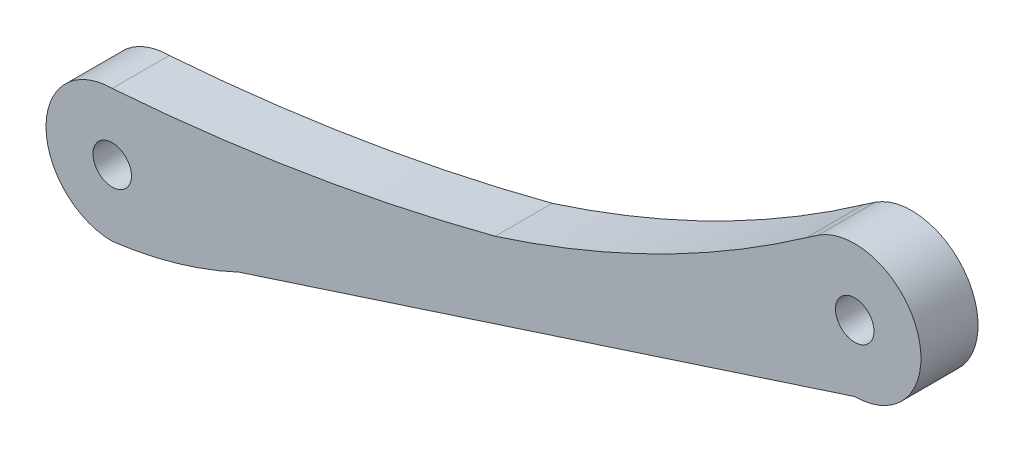
ISO-10303-21;
HEADER;
FILE_DESCRIPTION(('STEP AP214'),'2;1');
FILE_NAME('part.step','',(''),(''),'','','');
FILE_SCHEMA(('AUTOMOTIVE_DESIGN { 1 0 10303 214 1 1 1 1 }'));
ENDSEC;
DATA;
#1=APPLICATION_CONTEXT('core data for automotive mechanical design processes');
#2=APPLICATION_PROTOCOL_DEFINITION('international standard','automotive_design',2000,#1);
#3=PRODUCT_CONTEXT('',#1,'mechanical');
#4=PRODUCT('Part','Part','',(#3));
#5=PRODUCT_RELATED_PRODUCT_CATEGORY('part','',(#4));
#6=PRODUCT_DEFINITION_FORMATION('','',#4);
#7=PRODUCT_DEFINITION_CONTEXT('part definition',#1,'design');
#8=PRODUCT_DEFINITION('design','',#6,#7);
#9=PRODUCT_DEFINITION_SHAPE('','',#8);
#10=(LENGTH_UNIT() NAMED_UNIT(*) SI_UNIT(.MILLI.,.METRE.));
#11=(NAMED_UNIT(*) PLANE_ANGLE_UNIT() SI_UNIT($,.RADIAN.));
#12=(NAMED_UNIT(*) SI_UNIT($,.STERADIAN.) SOLID_ANGLE_UNIT());
#13=UNCERTAINTY_MEASURE_WITH_UNIT(LENGTH_MEASURE(1.E-05),#10,'distance_accuracy_value','');
#14=(GEOMETRIC_REPRESENTATION_CONTEXT(3) GLOBAL_UNCERTAINTY_ASSIGNED_CONTEXT((#13)) GLOBAL_UNIT_ASSIGNED_CONTEXT((#10,
#11,#12)) REPRESENTATION_CONTEXT('',''));
#15=CARTESIAN_POINT('',(0.,0.,0.));
#16=DIRECTION('',(0.,0.,1.));
#17=DIRECTION('',(1.,0.,0.));
#18=AXIS2_PLACEMENT_3D('',#15,#16,#17);
#19=CARTESIAN_POINT('',(3.52092702977232,128.68718187856,-6.));
#20=DIRECTION('',(0.,0.,1.));
#21=DIRECTION('',(-1.,0.,0.));
#22=AXIS2_PLACEMENT_3D('',#19,#20,#21);
#23=CYLINDRICAL_SURFACE('',#22,120.781117317153);
#24=CARTESIAN_POINT('',(3.52092702977232,128.68718187856,0.));
#25=DIRECTION('',(0.,0.,1.));
#26=DIRECTION('',(1.,0.,0.));
#27=AXIS2_PLACEMENT_3D('',#24,#25,#26);
#28=CIRCLE('',#27,120.781117317153);
#29=CARTESIAN_POINT('',(40.235925581119,13.6216041337166,0.));
#30=VERTEX_POINT('',#29);
#31=CARTESIAN_POINT('',(72.9383830734779,29.8474373584522,0.));
#32=VERTEX_POINT('',#31);
#33=EDGE_CURVE('E134',#30,#32,#28,.T.);
#34=ORIENTED_EDGE('',*,*,#33,.T.);
#35=DIRECTION('',(0.,0.,1.));
#36=VECTOR('',#35,1.);
#37=CARTESIAN_POINT('',(72.9383830734779,29.8474373584522,-6.));
#38=LINE('',#37,#36);
#39=CARTESIAN_POINT('',(72.9383830734779,29.8474373584522,-6.));
#40=VERTEX_POINT('',#39);
#41=EDGE_CURVE('E133',#40,#32,#38,.T.);
#42=ORIENTED_EDGE('',*,*,#41,.F.);
#43=CARTESIAN_POINT('',(3.52092702977232,128.68718187856,-6.));
#44=DIRECTION('',(0.,0.,1.));
#45=DIRECTION('',(1.,0.,0.));
#46=AXIS2_PLACEMENT_3D('',#43,#44,#45);
#47=CIRCLE('',#46,120.781117317153);
#48=CARTESIAN_POINT('',(40.235925581119,13.6216041337166,-6.));
#49=VERTEX_POINT('',#48);
#50=EDGE_CURVE('E155',#49,#40,#47,.T.);
#51=ORIENTED_EDGE('',*,*,#50,.F.);
#52=DIRECTION('',(0.,0.,1.));
#53=VECTOR('',#52,1.);
#54=CARTESIAN_POINT('',(40.235925581119,13.6216041337166,-6.));
#55=LINE('',#54,#53);
#56=EDGE_CURVE('E11',#49,#30,#55,.T.);
#57=ORIENTED_EDGE('',*,*,#56,.T.);
#58=EDGE_LOOP('',(#34,#42,#51,#57));
#59=FACE_BOUND('',#58,.T.);
#60=ADVANCED_FACE('F37',(#59),#23,.F.);
#61=CARTESIAN_POINT('',(-16.5000266118403,231.345266574188,-6.));
#62=DIRECTION('',(0.,0.,1.));
#63=DIRECTION('',(-1.,0.,0.));
#64=AXIS2_PLACEMENT_3D('',#61,#62,#63);
#65=CYLINDRICAL_SURFACE('',#64,224.994580951929);
#66=CARTESIAN_POINT('',(-16.5000266118403,231.345266574188,0.));
#67=DIRECTION('',(0.,0.,1.));
#68=DIRECTION('',(1.,0.,0.));
#69=AXIS2_PLACEMENT_3D('',#66,#67,#68);
#70=CIRCLE('',#69,224.994580951929);
#71=CARTESIAN_POINT('',(0.,6.95651779309902,0.));
#72=VERTEX_POINT('',#71);
#73=EDGE_CURVE('E137',#72,#30,#70,.T.);
#74=ORIENTED_EDGE('',*,*,#73,.T.);
#75=ORIENTED_EDGE('',*,*,#56,.F.);
#76=CARTESIAN_POINT('',(-16.5000266118403,231.345266574188,-6.));
#77=DIRECTION('',(0.,0.,1.));
#78=DIRECTION('',(1.,0.,0.));
#79=AXIS2_PLACEMENT_3D('',#76,#77,#78);
#80=CIRCLE('',#79,224.994580951929);
#81=CARTESIAN_POINT('',(0.,6.95651779309902,-6.));
#82=VERTEX_POINT('',#81);
#83=EDGE_CURVE('E88',#82,#49,#80,.T.);
#84=ORIENTED_EDGE('',*,*,#83,.F.);
#85=DIRECTION('',(0.,0.,1.));
#86=VECTOR('',#85,1.);
#87=CARTESIAN_POINT('',(0.,6.95651779309902,-6.));
#88=LINE('',#87,#86);
#89=EDGE_CURVE('E45',#82,#72,#88,.T.);
#90=ORIENTED_EDGE('',*,*,#89,.T.);
#91=EDGE_LOOP('',(#74,#75,#84,#90));
#92=FACE_BOUND('',#91,.T.);
#93=ADVANCED_FACE('F165',(#92),#65,.F.);
#94=CARTESIAN_POINT('',(0.,0.,-6.));
#95=DIRECTION('',(0.,0.,1.));
#96=DIRECTION('',(-1.,0.,0.));
#97=AXIS2_PLACEMENT_3D('',#94,#95,#96);
#98=CYLINDRICAL_SURFACE('',#97,6.95651779309902);
#99=CARTESIAN_POINT('',(0.,0.,0.));
#100=DIRECTION('',(0.,0.,1.));
#101=DIRECTION('',(1.,0.,0.));
#102=AXIS2_PLACEMENT_3D('',#99,#100,#101);
#103=CIRCLE('',#102,6.95651779309902);
#104=CARTESIAN_POINT('',(0.,-6.95651779309902,0.));
#105=VERTEX_POINT('',#104);
#106=EDGE_CURVE('E139',#72,#105,#103,.T.);
#107=ORIENTED_EDGE('',*,*,#106,.F.);
#108=ORIENTED_EDGE('',*,*,#89,.F.);
#109=CARTESIAN_POINT('',(0.,0.,-6.));
#110=DIRECTION('',(0.,0.,1.));
#111=DIRECTION('',(1.,0.,0.));
#112=AXIS2_PLACEMENT_3D('',#109,#110,#111);
#113=CIRCLE('',#112,6.95651779309902);
#114=CARTESIAN_POINT('',(0.,-6.95651779309902,-6.));
#115=VERTEX_POINT('',#114);
#116=EDGE_CURVE('E122',#82,#115,#113,.T.);
#117=ORIENTED_EDGE('',*,*,#116,.T.);
#118=DIRECTION('',(0.,0.,1.));
#119=VECTOR('',#118,1.);
#120=CARTESIAN_POINT('',(0.,-6.95651779309902,-6.));
#121=LINE('',#120,#119);
#122=EDGE_CURVE('E159',#115,#105,#121,.T.);
#123=ORIENTED_EDGE('',*,*,#122,.T.);
#124=EDGE_LOOP('',(#107,#108,#117,#123));
#125=FACE_BOUND('',#124,.T.);
#126=ADVANCED_FACE('F175',(#125),#98,.T.);
#127=CARTESIAN_POINT('',(-5.43504198912419,36.7736432938048,-6.));
#128=DIRECTION('',(0.,0.,1.));
#129=DIRECTION('',(-1.,0.,0.));
#130=AXIS2_PLACEMENT_3D('',#127,#128,#129);
#131=CYLINDRICAL_SURFACE('',#130,44.0666162770651);
#132=CARTESIAN_POINT('',(-5.43504198912419,36.7736432938048,0.));
#133=DIRECTION('',(0.,0.,1.));
#134=DIRECTION('',(1.,0.,0.));
#135=AXIS2_PLACEMENT_3D('',#132,#133,#134);
#136=CIRCLE('',#135,44.0666162770651);
#137=CARTESIAN_POINT('',(13.3235006682701,-3.10095698608287,0.));
#138=VERTEX_POINT('',#137);
#139=EDGE_CURVE('E142',#105,#138,#136,.T.);
#140=ORIENTED_EDGE('',*,*,#139,.F.);
#141=ORIENTED_EDGE('',*,*,#122,.F.);
#142=CARTESIAN_POINT('',(-5.43504198912419,36.7736432938048,-6.));
#143=DIRECTION('',(0.,0.,1.));
#144=DIRECTION('',(1.,0.,0.));
#145=AXIS2_PLACEMENT_3D('',#142,#143,#144);
#146=CIRCLE('',#145,44.0666162770651);
#147=CARTESIAN_POINT('',(13.3235006682701,-3.10095698608287,-6.));
#148=VERTEX_POINT('',#147);
#149=EDGE_CURVE('E120',#115,#148,#146,.T.);
#150=ORIENTED_EDGE('',*,*,#149,.T.);
#151=DIRECTION('',(0.,0.,1.));
#152=VECTOR('',#151,1.);
#153=CARTESIAN_POINT('',(13.3235006682701,-3.10095698608287,-6.));
#154=LINE('',#153,#152);
#155=EDGE_CURVE('E114',#148,#138,#154,.T.);
#156=ORIENTED_EDGE('',*,*,#155,.T.);
#157=EDGE_LOOP('',(#140,#141,#150,#156));
#158=FACE_BOUND('',#157,.T.);
#159=ADVANCED_FACE('F178',(#158),#131,.T.);
#160=CARTESIAN_POINT('',(2.18464276354417,-6.72139803148819,-6.));
#161=DIRECTION('',(-0.309110183145973,0.951026232380297,0.));
#162=DIRECTION('',(-0.951026232380297,-0.309110183145973,0.));
#163=AXIS2_PLACEMENT_3D('',#160,#161,#162);
#164=PLANE('',#163);
#165=DIRECTION('',(0.951026232380297,0.309110183145973,0.));
#166=VECTOR('',#165,1.);
#167=CARTESIAN_POINT('',(2.18464276354417,-6.72139803148819,0.));
#168=LINE('',#167,#166);
#169=CARTESIAN_POINT('',(78.0200191531507,17.9272249892081,0.));
#170=VERTEX_POINT('',#169);
#171=EDGE_CURVE('E145',#138,#170,#168,.T.);
#172=ORIENTED_EDGE('',*,*,#171,.F.);
#173=ORIENTED_EDGE('',*,*,#155,.F.);
#174=DIRECTION('',(0.951026232380297,0.309110183145973,0.));
#175=VECTOR('',#174,1.);
#176=CARTESIAN_POINT('',(2.18464276354417,-6.72139803148819,-6.));
#177=LINE('',#176,#175);
#178=CARTESIAN_POINT('',(78.0200191531507,17.9272249892081,-6.));
#179=VERTEX_POINT('',#178);
#180=EDGE_CURVE('E104',#148,#179,#177,.T.);
#181=ORIENTED_EDGE('',*,*,#180,.T.);
#182=DIRECTION('',(0.,0.,1.));
#183=VECTOR('',#182,1.);
#184=CARTESIAN_POINT('',(78.0200191531507,17.9272249892081,-6.));
#185=LINE('',#184,#183);
#186=EDGE_CURVE('E109',#179,#170,#185,.T.);
#187=ORIENTED_EDGE('',*,*,#186,.T.);
#188=EDGE_LOOP('',(#172,#173,#181,#187));
#189=FACE_BOUND('',#188,.T.);
#190=ADVANCED_FACE('F117',(#189),#164,.F.);
#191=CARTESIAN_POINT('',(78.0200191531507,24.8875466609063,-6.));
#192=DIRECTION('',(0.,0.,1.));
#193=DIRECTION('',(-1.,0.,0.));
#194=AXIS2_PLACEMENT_3D('',#191,#192,#193);
#195=CYLINDRICAL_SURFACE('',#194,6.96032167169823);
#196=CARTESIAN_POINT('',(78.0200191531507,24.8875466609063,0.));
#197=DIRECTION('',(0.,0.,1.));
#198=DIRECTION('',(1.,0.,0.));
#199=AXIS2_PLACEMENT_3D('',#196,#197,#198);
#200=CIRCLE('',#199,6.96032167169823);
#201=CARTESIAN_POINT('',(74.1564479492747,30.677097189755,0.));
#202=VERTEX_POINT('',#201);
#203=EDGE_CURVE('E111',#170,#202,#200,.T.);
#204=ORIENTED_EDGE('',*,*,#203,.F.);
#205=ORIENTED_EDGE('',*,*,#186,.F.);
#206=CARTESIAN_POINT('',(78.0200191531507,24.8875466609063,-6.));
#207=DIRECTION('',(0.,0.,1.));
#208=DIRECTION('',(1.,0.,0.));
#209=AXIS2_PLACEMENT_3D('',#206,#207,#208);
#210=CIRCLE('',#209,6.96032167169823);
#211=CARTESIAN_POINT('',(74.1564479492747,30.677097189755,-6.));
#212=VERTEX_POINT('',#211);
#213=EDGE_CURVE('E99',#179,#212,#210,.T.);
#214=ORIENTED_EDGE('',*,*,#213,.T.);
#215=DIRECTION('',(0.,0.,1.));
#216=VECTOR('',#215,1.);
#217=CARTESIAN_POINT('',(74.1564479492747,30.677097189755,-6.));
#218=LINE('',#217,#216);
#219=EDGE_CURVE('E115',#212,#202,#218,.T.);
#220=ORIENTED_EDGE('',*,*,#219,.T.);
#221=EDGE_LOOP('',(#204,#205,#214,#220));
#222=FACE_BOUND('',#221,.T.);
#223=ADVANCED_FACE('F110',(#222),#195,.T.);
#224=CARTESIAN_POINT('',(78.0200191531507,24.8875466609063,-6.));
#225=DIRECTION('',(0.,0.,1.));
#226=DIRECTION('',(-1.,0.,0.));
#227=AXIS2_PLACEMENT_3D('',#224,#225,#226);
#228=CYLINDRICAL_SURFACE('',#227,2.02398786423874);
#229=CARTESIAN_POINT('',(78.0200191531507,24.8875466609063,-6.));
#230=DIRECTION('',(0.,0.,1.));
#231=DIRECTION('',(1.,0.,0.));
#232=AXIS2_PLACEMENT_3D('',#229,#230,#231);
#233=CIRCLE('',#232,2.02398786423874);
#234=CARTESIAN_POINT('',(80.0440070173894,24.8875466609063,-6.));
#235=VERTEX_POINT('',#234);
#236=EDGE_CURVE('E127',#235,#235,#233,.T.);
#237=ORIENTED_EDGE('',*,*,#236,.F.);
#238=EDGE_LOOP('',(#237));
#239=FACE_BOUND('',#238,.T.);
#240=CARTESIAN_POINT('',(78.0200191531507,24.8875466609063,0.));
#241=DIRECTION('',(0.,0.,1.));
#242=DIRECTION('',(1.,0.,0.));
#243=AXIS2_PLACEMENT_3D('',#240,#241,#242);
#244=CIRCLE('',#243,2.02398786423874);
#245=CARTESIAN_POINT('',(80.0440070173894,24.8875466609063,0.));
#246=VERTEX_POINT('',#245);
#247=EDGE_CURVE('E149',#246,#246,#244,.T.);
#248=ORIENTED_EDGE('',*,*,#247,.T.);
#249=EDGE_LOOP('',(#248));
#250=FACE_BOUND('',#249,.T.);
#251=ADVANCED_FACE('F235',(#239,#250),#228,.F.);
#252=CARTESIAN_POINT('',(9.22776432351113,-13.547739905582,-6.));
#253=DIRECTION('',(0.562948162750431,-0.826492205683704,0.));
#254=DIRECTION('',(0.826492205683704,0.562948162750431,0.));
#255=AXIS2_PLACEMENT_3D('',#252,#253,#254);
#256=PLANE('',#255);
#257=DIRECTION('',(-0.826492205683704,-0.562948162750431,0.));
#258=VECTOR('',#257,1.);
#259=CARTESIAN_POINT('',(9.22776432351113,-13.547739905582,0.));
#260=LINE('',#259,#258);
#261=EDGE_CURVE('E76',#202,#32,#260,.T.);
#262=ORIENTED_EDGE('',*,*,#261,.F.);
#263=ORIENTED_EDGE('',*,*,#219,.F.);
#264=DIRECTION('',(-0.826492205683704,-0.562948162750431,0.));
#265=VECTOR('',#264,1.);
#266=CARTESIAN_POINT('',(9.22776432351113,-13.547739905582,-6.));
#267=LINE('',#266,#265);
#268=EDGE_CURVE('E53',#212,#40,#267,.T.);
#269=ORIENTED_EDGE('',*,*,#268,.T.);
#270=ORIENTED_EDGE('',*,*,#41,.T.);
#271=EDGE_LOOP('',(#262,#263,#269,#270));
#272=FACE_BOUND('',#271,.T.);
#273=ADVANCED_FACE('F227',(#272),#256,.F.);
#274=CARTESIAN_POINT('',(0.,0.,-6.));
#275=DIRECTION('',(0.,0.,1.));
#276=DIRECTION('',(-1.,0.,0.));
#277=AXIS2_PLACEMENT_3D('',#274,#275,#276);
#278=CYLINDRICAL_SURFACE('',#277,2.02304351129445);
#279=CARTESIAN_POINT('',(0.,0.,-6.));
#280=DIRECTION('',(0.,0.,1.));
#281=DIRECTION('',(1.,0.,0.));
#282=AXIS2_PLACEMENT_3D('',#279,#280,#281);
#283=CIRCLE('',#282,2.02304351129445);
#284=CARTESIAN_POINT('',(2.02304351129445,0.,-6.));
#285=VERTEX_POINT('',#284);
#286=EDGE_CURVE('E130',#285,#285,#283,.T.);
#287=ORIENTED_EDGE('',*,*,#286,.F.);
#288=EDGE_LOOP('',(#287));
#289=FACE_BOUND('',#288,.T.);
#290=CARTESIAN_POINT('',(0.,0.,0.));
#291=DIRECTION('',(0.,0.,1.));
#292=DIRECTION('',(1.,0.,0.));
#293=AXIS2_PLACEMENT_3D('',#290,#291,#292);
#294=CIRCLE('',#293,2.02304351129445);
#295=CARTESIAN_POINT('',(2.02304351129445,0.,0.));
#296=VERTEX_POINT('',#295);
#297=EDGE_CURVE('E152',#296,#296,#294,.T.);
#298=ORIENTED_EDGE('',*,*,#297,.T.);
#299=EDGE_LOOP('',(#298));
#300=FACE_BOUND('',#299,.T.);
#301=ADVANCED_FACE('F221',(#289,#300),#278,.F.);
#302=CARTESIAN_POINT('',(0.,0.,-6.));
#303=DIRECTION('',(0.,0.,-1.));
#304=DIRECTION('',(1.,0.,0.));
#305=AXIS2_PLACEMENT_3D('',#302,#303,#304);
#306=PLANE('',#305);
#307=ORIENTED_EDGE('',*,*,#50,.T.);
#308=ORIENTED_EDGE('',*,*,#268,.F.);
#309=ORIENTED_EDGE('',*,*,#213,.F.);
#310=ORIENTED_EDGE('',*,*,#180,.F.);
#311=ORIENTED_EDGE('',*,*,#149,.F.);
#312=ORIENTED_EDGE('',*,*,#116,.F.);
#313=ORIENTED_EDGE('',*,*,#83,.T.);
#314=EDGE_LOOP('',(#307,#308,#309,#310,#311,#312,#313));
#315=FACE_BOUND('',#314,.T.);
#316=ORIENTED_EDGE('',*,*,#236,.T.);
#317=EDGE_LOOP('',(#316));
#318=FACE_BOUND('',#317,.T.);
#319=ORIENTED_EDGE('',*,*,#286,.T.);
#320=EDGE_LOOP('',(#319));
#321=FACE_BOUND('',#320,.T.);
#322=ADVANCED_FACE('F101',(#315,#318,#321),#306,.T.);
#323=CARTESIAN_POINT('',(0.,0.,0.));
#324=DIRECTION('',(0.,0.,-1.));
#325=DIRECTION('',(1.,0.,0.));
#326=AXIS2_PLACEMENT_3D('',#323,#324,#325);
#327=PLANE('',#326);
#328=ORIENTED_EDGE('',*,*,#33,.F.);
#329=ORIENTED_EDGE('',*,*,#73,.F.);
#330=ORIENTED_EDGE('',*,*,#106,.T.);
#331=ORIENTED_EDGE('',*,*,#139,.T.);
#332=ORIENTED_EDGE('',*,*,#171,.T.);
#333=ORIENTED_EDGE('',*,*,#203,.T.);
#334=ORIENTED_EDGE('',*,*,#261,.T.);
#335=EDGE_LOOP('',(#328,#329,#330,#331,#332,#333,#334));
#336=FACE_BOUND('',#335,.T.);
#337=ORIENTED_EDGE('',*,*,#247,.F.);
#338=EDGE_LOOP('',(#337));
#339=FACE_BOUND('',#338,.T.);
#340=ORIENTED_EDGE('',*,*,#297,.F.);
#341=EDGE_LOOP('',(#340));
#342=FACE_BOUND('',#341,.T.);
#343=ADVANCED_FACE('F168',(#336,#339,#342),#327,.F.);
#344=CLOSED_SHELL('',(#60,#93,#126,#159,#190,#223,#251,#273,#301,#322,#343));
#345=MANIFOLD_SOLID_BREP('B2',#344);
#346=ADVANCED_BREP_SHAPE_REPRESENTATION('',(#18,#345),#14);
#347=SHAPE_DEFINITION_REPRESENTATION(#9,#346);
ENDSEC;
END-ISO-10303-21;
